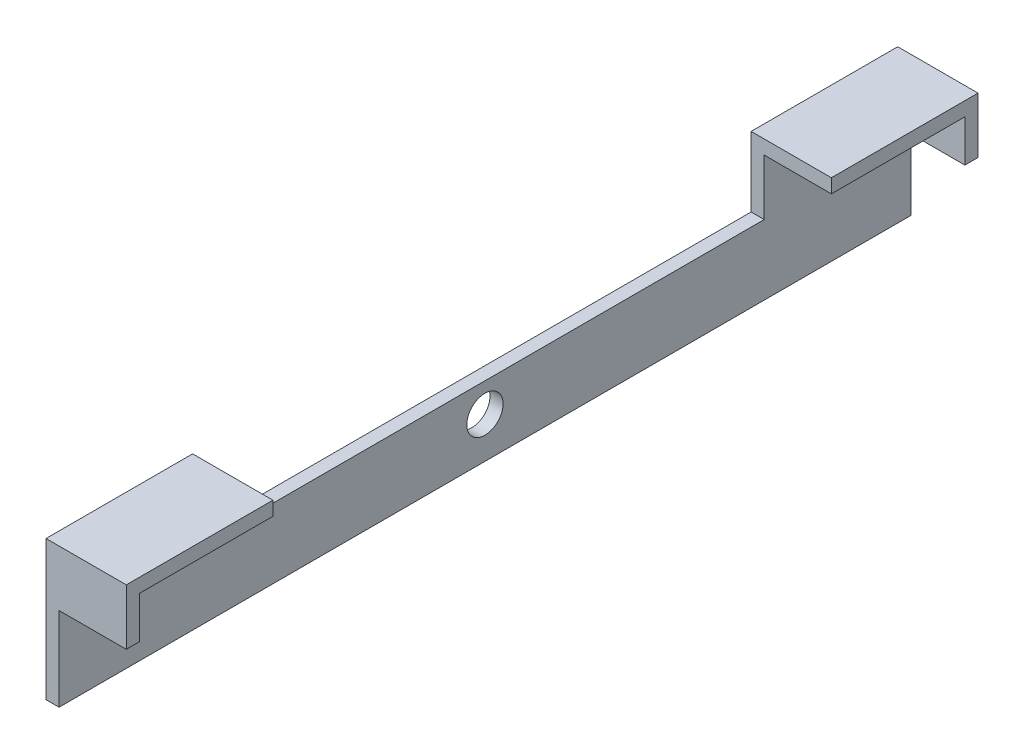
ISO-10303-21;
HEADER;
FILE_DESCRIPTION(('STEP AP214'),'2;1');
FILE_NAME('part.step','',(''),(''),'','','');
FILE_SCHEMA(('AUTOMOTIVE_DESIGN { 1 0 10303 214 1 1 1 1 }'));
ENDSEC;
DATA;
#1=APPLICATION_CONTEXT('core data for automotive mechanical design processes');
#2=APPLICATION_PROTOCOL_DEFINITION('international standard','automotive_design',2000,#1);
#3=PRODUCT_CONTEXT('',#1,'mechanical');
#4=PRODUCT('Part','Part','',(#3));
#5=PRODUCT_RELATED_PRODUCT_CATEGORY('part','',(#4));
#6=PRODUCT_DEFINITION_FORMATION('','',#4);
#7=PRODUCT_DEFINITION_CONTEXT('part definition',#1,'design');
#8=PRODUCT_DEFINITION('design','',#6,#7);
#9=PRODUCT_DEFINITION_SHAPE('','',#8);
#10=(LENGTH_UNIT() NAMED_UNIT(*) SI_UNIT(.MILLI.,.METRE.));
#11=(NAMED_UNIT(*) PLANE_ANGLE_UNIT() SI_UNIT($,.RADIAN.));
#12=(NAMED_UNIT(*) SI_UNIT($,.STERADIAN.) SOLID_ANGLE_UNIT());
#13=UNCERTAINTY_MEASURE_WITH_UNIT(LENGTH_MEASURE(1.E-05),#10,'distance_accuracy_value','');
#14=(GEOMETRIC_REPRESENTATION_CONTEXT(3) GLOBAL_UNCERTAINTY_ASSIGNED_CONTEXT((#13)) GLOBAL_UNIT_ASSIGNED_CONTEXT((#10,
#11,#12)) REPRESENTATION_CONTEXT('',''));
#15=CARTESIAN_POINT('',(0.,0.,0.));
#16=DIRECTION('',(0.,0.,1.));
#17=DIRECTION('',(1.,0.,0.));
#18=AXIS2_PLACEMENT_3D('',#15,#16,#17);
#19=CARTESIAN_POINT('',(-105.0925,45.7200000000001,-154.94));
#20=DIRECTION('',(1.,0.,0.));
#21=DIRECTION('',(0.,0.,-1.));
#22=AXIS2_PLACEMENT_3D('',#19,#20,#21);
#23=PLANE('',#22);
#24=DIRECTION('',(0.,0.,1.));
#25=VECTOR('',#24,1.);
#26=CARTESIAN_POINT('',(-105.0925,50.8000000000001,-154.94));
#27=LINE('',#26,#25);
#28=CARTESIAN_POINT('',(-105.0925,50.8000000000001,-154.94));
#29=VERTEX_POINT('',#28);
#30=CARTESIAN_POINT('',(-105.0925,50.8000000000001,-101.6));
#31=VERTEX_POINT('',#30);
#32=EDGE_CURVE('E294',#29,#31,#27,.T.);
#33=ORIENTED_EDGE('',*,*,#32,.T.);
#34=DIRECTION('',(0.,1.,0.));
#35=VECTOR('',#34,1.);
#36=CARTESIAN_POINT('',(-105.0925,25.4000000000001,-101.6));
#37=LINE('',#36,#35);
#38=CARTESIAN_POINT('',(-105.0925,45.72,-101.6));
#39=VERTEX_POINT('',#38);
#40=EDGE_CURVE('E194',#39,#31,#37,.T.);
#41=ORIENTED_EDGE('',*,*,#40,.F.);
#42=DIRECTION('',(0.,0.,1.));
#43=VECTOR('',#42,1.);
#44=CARTESIAN_POINT('',(-105.0925,45.7200000000001,-154.94));
#45=LINE('',#44,#43);
#46=CARTESIAN_POINT('',(-105.0925,45.72,-150.1775));
#47=VERTEX_POINT('',#46);
#48=EDGE_CURVE('E299',#47,#39,#45,.T.);
#49=ORIENTED_EDGE('',*,*,#48,.F.);
#50=DIRECTION('',(0.,-1.,0.));
#51=VECTOR('',#50,1.);
#52=CARTESIAN_POINT('',(-105.0925,50.8,-150.1775));
#53=LINE('',#52,#51);
#54=CARTESIAN_POINT('',(-105.0925,30.4800000000001,-150.1775));
#55=VERTEX_POINT('',#54);
#56=EDGE_CURVE('E205',#47,#55,#53,.T.);
#57=ORIENTED_EDGE('',*,*,#56,.T.);
#58=DIRECTION('',(0.,0.,-1.));
#59=VECTOR('',#58,1.);
#60=CARTESIAN_POINT('',(-105.0925,30.4800000000001,-150.1775));
#61=LINE('',#60,#59);
#62=CARTESIAN_POINT('',(-105.0925,30.48,-154.94));
#63=VERTEX_POINT('',#62);
#64=EDGE_CURVE('E212',#55,#63,#61,.T.);
#65=ORIENTED_EDGE('',*,*,#64,.T.);
#66=DIRECTION('',(0.,1.,0.));
#67=VECTOR('',#66,1.);
#68=CARTESIAN_POINT('',(-105.0925,45.7200000000001,-154.94));
#69=LINE('',#68,#67);
#70=EDGE_CURVE('E273',#63,#29,#69,.T.);
#71=ORIENTED_EDGE('',*,*,#70,.T.);
#72=EDGE_LOOP('',(#33,#41,#49,#57,#65,#71));
#73=FACE_BOUND('',#72,.T.);
#74=ADVANCED_FACE('F38',(#73),#23,.T.);
#75=CARTESIAN_POINT('',(-134.3025,14.8590000000001,0.));
#76=DIRECTION('',(1.,0.,0.));
#77=DIRECTION('',(0.,0.,-1.));
#78=AXIS2_PLACEMENT_3D('',#75,#76,#77);
#79=CYLINDRICAL_SURFACE('',#78,6.604);
#80=CARTESIAN_POINT('',(-129.54,14.8590000000001,0.));
#81=DIRECTION('',(1.,0.,0.));
#82=DIRECTION('',(0.,0.,-1.));
#83=AXIS2_PLACEMENT_3D('',#80,#81,#82);
#84=CIRCLE('',#83,6.604);
#85=CARTESIAN_POINT('',(-129.54,14.8590000000001,-6.60399999999997));
#86=VERTEX_POINT('',#85);
#87=EDGE_CURVE('E42',#86,#86,#84,.T.);
#88=CARTESIAN_POINT('',(-134.3025,14.8590000000001,0.));
#89=DIRECTION('',(1.,0.,0.));
#90=DIRECTION('',(0.,0.,-1.));
#91=AXIS2_PLACEMENT_3D('',#88,#89,#90);
#92=CIRCLE('',#91,6.604);
#93=CARTESIAN_POINT('',(-134.3025,14.8590000000001,-6.60399999999997));
#94=VERTEX_POINT('',#93);
#95=EDGE_CURVE('E463',#94,#94,#92,.T.);
#96=CARTESIAN_POINT('',(-129.54,14.8590000000001,-6.60399999999997));
#97=CARTESIAN_POINT('',(-129.589609375,14.8590000000001,-6.60399999999997));
#98=CARTESIAN_POINT('',(-129.63921875,14.8590000000001,-6.60399999999997));
#99=CARTESIAN_POINT('',(-129.7384375,14.8590000000001,-6.60399999999997));
#100=CARTESIAN_POINT('',(-129.788046875,14.8590000000001,-6.60399999999997));
#101=CARTESIAN_POINT('',(-129.887265625,14.8590000000001,-6.60399999999997));
#102=CARTESIAN_POINT('',(-129.936875,14.8590000000001,-6.60399999999997));
#103=CARTESIAN_POINT('',(-130.03609375,14.8590000000001,-6.60399999999997));
#104=CARTESIAN_POINT('',(-130.085703125,14.8590000000001,-6.60399999999997));
#105=CARTESIAN_POINT('',(-130.184921875,14.8590000000001,-6.60399999999997));
#106=CARTESIAN_POINT('',(-130.23453125,14.8590000000001,-6.60399999999997));
#107=CARTESIAN_POINT('',(-130.33375,14.8590000000001,-6.60399999999997));
#108=CARTESIAN_POINT('',(-130.383359375,14.8590000000001,-6.60399999999997));
#109=CARTESIAN_POINT('',(-130.482578125,14.8590000000001,-6.60399999999997));
#110=CARTESIAN_POINT('',(-130.5321875,14.8590000000001,-6.60399999999997));
#111=CARTESIAN_POINT('',(-130.63140625,14.8590000000001,-6.60399999999997));
#112=CARTESIAN_POINT('',(-130.681015625,14.8590000000001,-6.60399999999997));
#113=CARTESIAN_POINT('',(-130.780234375,14.8590000000001,-6.60399999999997));
#114=CARTESIAN_POINT('',(-130.82984375,14.8590000000001,-6.60399999999997));
#115=CARTESIAN_POINT('',(-130.9290625,14.8590000000001,-6.60399999999997));
#116=CARTESIAN_POINT('',(-130.978671875,14.8590000000001,-6.60399999999997));
#117=CARTESIAN_POINT('',(-131.077890625,14.8590000000001,-6.60399999999997));
#118=CARTESIAN_POINT('',(-131.1275,14.8590000000001,-6.60399999999997));
#119=CARTESIAN_POINT('',(-131.22671875,14.8590000000001,-6.60399999999997));
#120=CARTESIAN_POINT('',(-131.276328125,14.8590000000001,-6.60399999999997));
#121=CARTESIAN_POINT('',(-131.375546875,14.8590000000001,-6.60399999999997));
#122=CARTESIAN_POINT('',(-131.42515625,14.8590000000001,-6.60399999999997));
#123=CARTESIAN_POINT('',(-131.524375,14.8590000000001,-6.60399999999997));
#124=CARTESIAN_POINT('',(-131.573984375,14.8590000000001,-6.60399999999997));
#125=CARTESIAN_POINT('',(-131.673203125,14.8590000000001,-6.60399999999997));
#126=CARTESIAN_POINT('',(-131.7228125,14.8590000000001,-6.60399999999997));
#127=CARTESIAN_POINT('',(-131.82203125,14.8590000000001,-6.60399999999997));
#128=CARTESIAN_POINT('',(-131.871640625,14.8590000000001,-6.60399999999997));
#129=CARTESIAN_POINT('',(-131.970859375,14.8590000000001,-6.60399999999997));
#130=CARTESIAN_POINT('',(-132.02046875,14.8590000000001,-6.60399999999997));
#131=CARTESIAN_POINT('',(-132.1196875,14.8590000000001,-6.60399999999997));
#132=CARTESIAN_POINT('',(-132.169296875,14.8590000000001,-6.60399999999997));
#133=CARTESIAN_POINT('',(-132.268515625,14.8590000000001,-6.60399999999997));
#134=CARTESIAN_POINT('',(-132.318125,14.8590000000001,-6.60399999999997));
#135=CARTESIAN_POINT('',(-132.41734375,14.8590000000001,-6.60399999999997));
#136=CARTESIAN_POINT('',(-132.466953125,14.8590000000001,-6.60399999999997));
#137=CARTESIAN_POINT('',(-132.566171875,14.8590000000001,-6.60399999999997));
#138=CARTESIAN_POINT('',(-132.61578125,14.8590000000001,-6.60399999999997));
#139=CARTESIAN_POINT('',(-132.715,14.8590000000001,-6.60399999999997));
#140=CARTESIAN_POINT('',(-132.764609375,14.8590000000001,-6.60399999999997));
#141=CARTESIAN_POINT('',(-132.863828125,14.8590000000001,-6.60399999999997));
#142=CARTESIAN_POINT('',(-132.9134375,14.8590000000001,-6.60399999999997));
#143=CARTESIAN_POINT('',(-133.01265625,14.8590000000001,-6.60399999999997));
#144=CARTESIAN_POINT('',(-133.062265625,14.8590000000001,-6.60399999999997));
#145=CARTESIAN_POINT('',(-133.161484375,14.8590000000001,-6.60399999999997));
#146=CARTESIAN_POINT('',(-133.21109375,14.8590000000001,-6.60399999999997));
#147=CARTESIAN_POINT('',(-133.3103125,14.8590000000001,-6.60399999999997));
#148=CARTESIAN_POINT('',(-133.359921875,14.8590000000001,-6.60399999999997));
#149=CARTESIAN_POINT('',(-133.459140625,14.8590000000001,-6.60399999999997));
#150=CARTESIAN_POINT('',(-133.50875,14.8590000000001,-6.60399999999997));
#151=CARTESIAN_POINT('',(-133.60796875,14.8590000000001,-6.60399999999997));
#152=CARTESIAN_POINT('',(-133.657578125,14.8590000000001,-6.60399999999997));
#153=CARTESIAN_POINT('',(-133.756796875,14.8590000000001,-6.60399999999997));
#154=CARTESIAN_POINT('',(-133.80640625,14.8590000000001,-6.60399999999997));
#155=CARTESIAN_POINT('',(-133.905625,14.8590000000001,-6.60399999999997));
#156=CARTESIAN_POINT('',(-133.955234375,14.8590000000001,-6.60399999999997));
#157=CARTESIAN_POINT('',(-134.054453125,14.8590000000001,-6.60399999999997));
#158=CARTESIAN_POINT('',(-134.1040625,14.8590000000001,-6.60399999999997));
#159=CARTESIAN_POINT('',(-134.20328125,14.8590000000001,-6.60399999999997));
#160=CARTESIAN_POINT('',(-134.252890625,14.8590000000001,-6.60399999999997));
#161=CARTESIAN_POINT('',(-134.3025,14.8590000000001,-6.60399999999997));
#162=B_SPLINE_CURVE_WITH_KNOTS('',3,(#96,#97,#98,#99,#100,#101,#102,#103,#104,#105,#106,#107,
#108,#109,#110,#111,#112,#113,#114,#115,#116,#117,#118,#119,#120,#121,#122,#123,#124,#125,#126,
#127,#128,#129,#130,#131,#132,#133,#134,#135,#136,#137,#138,#139,#140,#141,#142,#143,#144,#145,
#146,#147,#148,#149,#150,#151,#152,#153,#154,#155,#156,#157,#158,#159,#160,#161),.UNSPECIFIED.,
.F.,.F.,(4,2,2,2,2,2,2,2,2,2,2,2,2,2,2,2,2,2,2,2,2,2,2,2,2,2,2,2,2,2,2,2,4),(0.,0.148828125,
0.29765625,0.446484375,0.5953125,0.744140625,0.892968750000001,1.041796875,1.190625,1.339453125,
1.48828125,1.637109375,1.7859375,1.934765625,2.08359375,2.232421875,2.38125,2.530078125,
2.67890625,2.827734375,2.9765625,3.125390625,3.27421875,3.423046875,3.571875,3.720703125,
3.86953125,4.018359375,4.1671875,4.316015625,4.46484375,4.613671875,4.76249999999998),.UNSPECIFIED.);
#163=EDGE_CURVE('BSEAM425',#86,#94,#162,.T.);
#164=ORIENTED_EDGE('',*,*,#87,.T.);
#165=ORIENTED_EDGE('',*,*,#95,.F.);
#166=ORIENTED_EDGE('',*,*,#163,.T.);
#167=ORIENTED_EDGE('',*,*,#163,.F.);
#168=EDGE_LOOP('',(#164,#166,#165,#167));
#169=FACE_BOUND('',#168,.T.);
#170=ADVANCED_FACE('F425',(#169),#79,.F.);
#171=CARTESIAN_POINT('',(-134.3025,0.,-154.94));
#172=DIRECTION('',(0.,-1.,0.));
#173=DIRECTION('',(0.,0.,-1.));
#174=AXIS2_PLACEMENT_3D('',#171,#172,#173);
#175=PLANE('',#174);
#176=DIRECTION('',(0.,0.,1.));
#177=VECTOR('',#176,1.);
#178=CARTESIAN_POINT('',(-129.54,0.,-154.94));
#179=LINE('',#178,#177);
#180=CARTESIAN_POINT('',(-129.54,0.,-154.94));
#181=VERTEX_POINT('',#180);
#182=CARTESIAN_POINT('',(-129.54,0.,154.94));
#183=VERTEX_POINT('',#182);
#184=EDGE_CURVE('E284',#181,#183,#179,.T.);
#185=ORIENTED_EDGE('',*,*,#184,.T.);
#186=DIRECTION('',(1.,0.,0.));
#187=VECTOR('',#186,1.);
#188=CARTESIAN_POINT('',(-134.3025,0.,154.94));
#189=LINE('',#188,#187);
#190=CARTESIAN_POINT('',(-134.3025,0.,154.94));
#191=VERTEX_POINT('',#190);
#192=EDGE_CURVE('E247',#191,#183,#189,.T.);
#193=ORIENTED_EDGE('',*,*,#192,.F.);
#194=DIRECTION('',(0.,0.,1.));
#195=VECTOR('',#194,1.);
#196=CARTESIAN_POINT('',(-134.3025,0.,-154.94));
#197=LINE('',#196,#195);
#198=CARTESIAN_POINT('',(-134.3025,0.,-154.94));
#199=VERTEX_POINT('',#198);
#200=EDGE_CURVE('E285',#199,#191,#197,.T.);
#201=ORIENTED_EDGE('',*,*,#200,.F.);
#202=DIRECTION('',(1.,0.,0.));
#203=VECTOR('',#202,1.);
#204=CARTESIAN_POINT('',(-134.3025,0.,-154.94));
#205=LINE('',#204,#203);
#206=EDGE_CURVE('E266',#199,#181,#205,.T.);
#207=ORIENTED_EDGE('',*,*,#206,.T.);
#208=EDGE_LOOP('',(#185,#193,#201,#207));
#209=FACE_BOUND('',#208,.T.);
#210=ADVANCED_FACE('F40',(#209),#175,.T.);
#211=CARTESIAN_POINT('',(0.,0.,154.94));
#212=DIRECTION('',(0.,0.,1.));
#213=DIRECTION('',(1.,0.,0.));
#214=AXIS2_PLACEMENT_3D('',#211,#212,#213);
#215=PLANE('',#214);
#216=DIRECTION('',(1.,0.,0.));
#217=VECTOR('',#216,1.);
#218=CARTESIAN_POINT('',(-134.3025,30.4800000000001,154.94));
#219=LINE('',#218,#217);
#220=CARTESIAN_POINT('',(-129.54,30.4800000000001,154.94));
#221=VERTEX_POINT('',#220);
#222=CARTESIAN_POINT('',(-105.0925,30.4800000000001,154.94));
#223=VERTEX_POINT('',#222);
#224=EDGE_CURVE('E225',#221,#223,#219,.T.);
#225=ORIENTED_EDGE('',*,*,#224,.T.);
#226=DIRECTION('',(0.,1.,0.));
#227=VECTOR('',#226,1.);
#228=CARTESIAN_POINT('',(-105.0925,45.72,154.94));
#229=LINE('',#228,#227);
#230=CARTESIAN_POINT('',(-105.0925,50.8000000000001,154.94));
#231=VERTEX_POINT('',#230);
#232=EDGE_CURVE('E255',#223,#231,#229,.T.);
#233=ORIENTED_EDGE('',*,*,#232,.T.);
#234=DIRECTION('',(-1.,0.,0.));
#235=VECTOR('',#234,1.);
#236=CARTESIAN_POINT('',(-105.0925,50.8000000000001,154.94));
#237=LINE('',#236,#235);
#238=CARTESIAN_POINT('',(-134.3025,50.8000000000001,154.94));
#239=VERTEX_POINT('',#238);
#240=EDGE_CURVE('E259',#231,#239,#237,.T.);
#241=ORIENTED_EDGE('',*,*,#240,.T.);
#242=DIRECTION('',(0.,-1.,0.));
#243=VECTOR('',#242,1.);
#244=CARTESIAN_POINT('',(-134.3025,50.8000000000001,154.94));
#245=LINE('',#244,#243);
#246=EDGE_CURVE('E263',#239,#191,#245,.T.);
#247=ORIENTED_EDGE('',*,*,#246,.T.);
#248=ORIENTED_EDGE('',*,*,#192,.T.);
#249=DIRECTION('',(0.,1.,0.));
#250=VECTOR('',#249,1.);
#251=CARTESIAN_POINT('',(-129.54,0.,154.94));
#252=LINE('',#251,#250);
#253=EDGE_CURVE('E251',#183,#221,#252,.T.);
#254=ORIENTED_EDGE('',*,*,#253,.T.);
#255=EDGE_LOOP('',(#225,#233,#241,#247,#248,#254));
#256=FACE_BOUND('',#255,.T.);
#257=ADVANCED_FACE('F353',(#256),#215,.T.);
#258=CARTESIAN_POINT('',(-134.3025,30.4800000000001,150.1775));
#259=DIRECTION('',(0.,-1.,0.));
#260=DIRECTION('',(0.,0.,-1.));
#261=AXIS2_PLACEMENT_3D('',#258,#259,#260);
#262=PLANE('',#261);
#263=ORIENTED_EDGE('',*,*,#224,.F.);
#264=DIRECTION('',(0.,0.,-1.));
#265=VECTOR('',#264,1.);
#266=CARTESIAN_POINT('',(-129.54,30.48,-154.94));
#267=LINE('',#266,#265);
#268=CARTESIAN_POINT('',(-129.54,30.4800000000001,150.1775));
#269=VERTEX_POINT('',#268);
#270=EDGE_CURVE('E240',#221,#269,#267,.T.);
#271=ORIENTED_EDGE('',*,*,#270,.T.);
#272=DIRECTION('',(1.,0.,0.));
#273=VECTOR('',#272,1.);
#274=CARTESIAN_POINT('',(-134.3025,30.4800000000001,150.1775));
#275=LINE('',#274,#273);
#276=CARTESIAN_POINT('',(-105.0925,30.4800000000001,150.1775));
#277=VERTEX_POINT('',#276);
#278=EDGE_CURVE('E230',#269,#277,#275,.T.);
#279=ORIENTED_EDGE('',*,*,#278,.T.);
#280=DIRECTION('',(0.,0.,1.));
#281=VECTOR('',#280,1.);
#282=CARTESIAN_POINT('',(-105.0925,30.4800000000001,150.1775));
#283=LINE('',#282,#281);
#284=EDGE_CURVE('E233',#277,#223,#283,.T.);
#285=ORIENTED_EDGE('',*,*,#284,.T.);
#286=EDGE_LOOP('',(#263,#271,#279,#285));
#287=FACE_BOUND('',#286,.T.);
#288=ADVANCED_FACE('F415',(#287),#262,.T.);
#289=CARTESIAN_POINT('',(0.,0.,-154.94));
#290=DIRECTION('',(0.,0.,1.));
#291=DIRECTION('',(1.,0.,0.));
#292=AXIS2_PLACEMENT_3D('',#289,#290,#291);
#293=PLANE('',#292);
#294=ORIENTED_EDGE('',*,*,#70,.F.);
#295=DIRECTION('',(-1.,0.,0.));
#296=VECTOR('',#295,1.);
#297=CARTESIAN_POINT('',(-105.0925,30.48,-154.94));
#298=LINE('',#297,#296);
#299=CARTESIAN_POINT('',(-129.54,30.48,-154.94));
#300=VERTEX_POINT('',#299);
#301=EDGE_CURVE('E204',#63,#300,#298,.T.);
#302=ORIENTED_EDGE('',*,*,#301,.T.);
#303=DIRECTION('',(0.,1.,0.));
#304=VECTOR('',#303,1.);
#305=CARTESIAN_POINT('',(-129.54,0.,-154.94));
#306=LINE('',#305,#304);
#307=EDGE_CURVE('E270',#181,#300,#306,.T.);
#308=ORIENTED_EDGE('',*,*,#307,.F.);
#309=ORIENTED_EDGE('',*,*,#206,.F.);
#310=DIRECTION('',(0.,-1.,0.));
#311=VECTOR('',#310,1.);
#312=CARTESIAN_POINT('',(-134.3025,50.8000000000001,-154.94));
#313=LINE('',#312,#311);
#314=CARTESIAN_POINT('',(-134.3025,50.8000000000001,-154.94));
#315=VERTEX_POINT('',#314);
#316=EDGE_CURVE('E281',#315,#199,#313,.T.);
#317=ORIENTED_EDGE('',*,*,#316,.F.);
#318=DIRECTION('',(-1.,0.,0.));
#319=VECTOR('',#318,1.);
#320=CARTESIAN_POINT('',(-105.0925,50.8000000000001,-154.94));
#321=LINE('',#320,#319);
#322=EDGE_CURVE('E277',#29,#315,#321,.T.);
#323=ORIENTED_EDGE('',*,*,#322,.F.);
#324=EDGE_LOOP('',(#294,#302,#308,#309,#317,#323));
#325=FACE_BOUND('',#324,.T.);
#326=ADVANCED_FACE('F340',(#325),#293,.F.);
#327=CARTESIAN_POINT('',(-105.0925,30.4800000000001,-150.1775));
#328=DIRECTION('',(0.,-1.,0.));
#329=DIRECTION('',(0.,0.,-1.));
#330=AXIS2_PLACEMENT_3D('',#327,#328,#329);
#331=PLANE('',#330);
#332=DIRECTION('',(-1.,0.,0.));
#333=VECTOR('',#332,1.);
#334=CARTESIAN_POINT('',(-105.0925,30.4800000000001,-150.1775));
#335=LINE('',#334,#333);
#336=CARTESIAN_POINT('',(-129.54,30.4800000000001,-150.1775));
#337=VERTEX_POINT('',#336);
#338=EDGE_CURVE('E208',#55,#337,#335,.T.);
#339=ORIENTED_EDGE('',*,*,#338,.T.);
#340=DIRECTION('',(0.,0.,-1.));
#341=VECTOR('',#340,1.);
#342=CARTESIAN_POINT('',(-129.54,30.48,-154.94));
#343=LINE('',#342,#341);
#344=EDGE_CURVE('E219',#337,#300,#343,.T.);
#345=ORIENTED_EDGE('',*,*,#344,.T.);
#346=ORIENTED_EDGE('',*,*,#301,.F.);
#347=ORIENTED_EDGE('',*,*,#64,.F.);
#348=EDGE_LOOP('',(#339,#345,#346,#347));
#349=FACE_BOUND('',#348,.T.);
#350=ADVANCED_FACE('F336',(#349),#331,.T.);
#351=CARTESIAN_POINT('',(-105.0925,50.8000000000001,-154.94));
#352=DIRECTION('',(0.,1.,0.));
#353=DIRECTION('',(-1.,0.,0.));
#354=AXIS2_PLACEMENT_3D('',#351,#352,#353);
#355=PLANE('',#354);
#356=DIRECTION('',(-1.,0.,0.));
#357=VECTOR('',#356,1.);
#358=CARTESIAN_POINT('',(-105.0925,50.8,101.6));
#359=LINE('',#358,#357);
#360=CARTESIAN_POINT('',(-105.0925,50.8,101.6));
#361=VERTEX_POINT('',#360);
#362=CARTESIAN_POINT('',(-134.3025,50.8,101.6));
#363=VERTEX_POINT('',#362);
#364=EDGE_CURVE('E176',#361,#363,#359,.T.);
#365=ORIENTED_EDGE('',*,*,#364,.T.);
#366=DIRECTION('',(0.,0.,1.));
#367=VECTOR('',#366,1.);
#368=CARTESIAN_POINT('',(-134.3025,50.8000000000001,-154.94));
#369=LINE('',#368,#367);
#370=EDGE_CURVE('E174',#363,#239,#369,.T.);
#371=ORIENTED_EDGE('',*,*,#370,.T.);
#372=ORIENTED_EDGE('',*,*,#240,.F.);
#373=EDGE_CURVE('E298',#361,#231,#27,.T.);
#374=ORIENTED_EDGE('',*,*,#373,.F.);
#375=EDGE_LOOP('',(#365,#371,#372,#374));
#376=FACE_BOUND('',#375,.T.);
#377=ADVANCED_FACE('F357',(#376),#355,.T.);
#378=CARTESIAN_POINT('',(-129.54,45.7200000000001,-154.94));
#379=DIRECTION('',(0.,-1.,0.));
#380=DIRECTION('',(0.,0.,-1.));
#381=AXIS2_PLACEMENT_3D('',#378,#379,#380);
#382=PLANE('',#381);
#383=ORIENTED_EDGE('',*,*,#48,.T.);
#384=DIRECTION('',(-1.,0.,0.));
#385=VECTOR('',#384,1.);
#386=CARTESIAN_POINT('',(-129.54,45.72,-101.6));
#387=LINE('',#386,#385);
#388=CARTESIAN_POINT('',(-129.54,45.72,-101.6));
#389=VERTEX_POINT('',#388);
#390=EDGE_CURVE('E197',#39,#389,#387,.T.);
#391=ORIENTED_EDGE('',*,*,#390,.T.);
#392=DIRECTION('',(0.,0.,1.));
#393=VECTOR('',#392,1.);
#394=CARTESIAN_POINT('',(-129.54,45.7200000000001,-154.94));
#395=LINE('',#394,#393);
#396=CARTESIAN_POINT('',(-129.54,45.72,-150.1775));
#397=VERTEX_POINT('',#396);
#398=EDGE_CURVE('E303',#397,#389,#395,.T.);
#399=ORIENTED_EDGE('',*,*,#398,.F.);
#400=DIRECTION('',(1.,0.,0.));
#401=VECTOR('',#400,1.);
#402=CARTESIAN_POINT('',(-129.54,45.72,-150.1775));
#403=LINE('',#402,#401);
#404=EDGE_CURVE('E63',#397,#47,#403,.T.);
#405=ORIENTED_EDGE('',*,*,#404,.T.);
#406=EDGE_LOOP('',(#383,#391,#399,#405));
#407=FACE_BOUND('',#406,.T.);
#408=ADVANCED_FACE('F327',(#407),#382,.T.);
#409=CARTESIAN_POINT('',(-129.54,0.,-154.94));
#410=DIRECTION('',(1.,0.,0.));
#411=DIRECTION('',(0.,0.,-1.));
#412=AXIS2_PLACEMENT_3D('',#409,#410,#411);
#413=PLANE('',#412);
#414=ORIENTED_EDGE('',*,*,#87,.F.);
#415=EDGE_LOOP('',(#414));
#416=FACE_BOUND('',#415,.T.);
#417=DIRECTION('',(0.,-1.,0.));
#418=VECTOR('',#417,1.);
#419=CARTESIAN_POINT('',(-129.54,0.,101.6));
#420=LINE('',#419,#418);
#421=CARTESIAN_POINT('',(-129.54,45.72,101.6));
#422=VERTEX_POINT('',#421);
#423=CARTESIAN_POINT('',(-129.54,25.4000000000001,101.6));
#424=VERTEX_POINT('',#423);
#425=EDGE_CURVE('E11',#422,#424,#420,.T.);
#426=ORIENTED_EDGE('',*,*,#425,.F.);
#427=CARTESIAN_POINT('',(-129.54,45.72,150.1775));
#428=VERTEX_POINT('',#427);
#429=EDGE_CURVE('E307',#422,#428,#395,.T.);
#430=ORIENTED_EDGE('',*,*,#429,.T.);
#431=DIRECTION('',(0.,-1.,0.));
#432=VECTOR('',#431,1.);
#433=CARTESIAN_POINT('',(-129.54,1.11022302462516E-13,150.1775));
#434=LINE('',#433,#432);
#435=EDGE_CURVE('E289',#428,#269,#434,.T.);
#436=ORIENTED_EDGE('',*,*,#435,.T.);
#437=ORIENTED_EDGE('',*,*,#270,.F.);
#438=ORIENTED_EDGE('',*,*,#253,.F.);
#439=ORIENTED_EDGE('',*,*,#184,.F.);
#440=ORIENTED_EDGE('',*,*,#307,.T.);
#441=ORIENTED_EDGE('',*,*,#344,.F.);
#442=DIRECTION('',(0.,1.,0.));
#443=VECTOR('',#442,1.);
#444=CARTESIAN_POINT('',(-129.54,0.,-150.1775));
#445=LINE('',#444,#443);
#446=EDGE_CURVE('E313',#337,#397,#445,.T.);
#447=ORIENTED_EDGE('',*,*,#446,.T.);
#448=ORIENTED_EDGE('',*,*,#398,.T.);
#449=DIRECTION('',(0.,-1.,0.));
#450=VECTOR('',#449,1.);
#451=CARTESIAN_POINT('',(-129.54,1.11022302462516E-13,-101.6));
#452=LINE('',#451,#450);
#453=CARTESIAN_POINT('',(-129.54,25.4000000000001,-101.6));
#454=VERTEX_POINT('',#453);
#455=EDGE_CURVE('E316',#389,#454,#452,.T.);
#456=ORIENTED_EDGE('',*,*,#455,.T.);
#457=DIRECTION('',(0.,0.,1.));
#458=VECTOR('',#457,1.);
#459=CARTESIAN_POINT('',(-129.54,25.4,-154.94));
#460=LINE('',#459,#458);
#461=EDGE_CURVE('E48',#454,#424,#460,.T.);
#462=ORIENTED_EDGE('',*,*,#461,.T.);
#463=EDGE_LOOP('',(#426,#430,#436,#437,#438,#439,#440,#441,#447,#448,#456,#462));
#464=FACE_BOUND('',#463,.T.);
#465=ADVANCED_FACE('F323',(#416,#464),#413,.T.);
#466=CARTESIAN_POINT('',(-134.3025,25.4000000000001,101.6));
#467=DIRECTION('',(0.,1.,0.));
#468=DIRECTION('',(0.,0.,1.));
#469=AXIS2_PLACEMENT_3D('',#466,#467,#468);
#470=PLANE('',#469);
#471=DIRECTION('',(1.,0.,0.));
#472=VECTOR('',#471,1.);
#473=CARTESIAN_POINT('',(-134.3025,25.4000000000001,-101.6));
#474=LINE('',#473,#472);
#475=CARTESIAN_POINT('',(-134.3025,25.4000000000001,-101.6));
#476=VERTEX_POINT('',#475);
#477=EDGE_CURVE('E55',#476,#454,#474,.T.);
#478=ORIENTED_EDGE('',*,*,#477,.F.);
#479=DIRECTION('',(0.,0.,-1.));
#480=VECTOR('',#479,1.);
#481=CARTESIAN_POINT('',(-134.3025,25.4000000000001,101.6));
#482=LINE('',#481,#480);
#483=CARTESIAN_POINT('',(-134.3025,25.4000000000001,101.6));
#484=VERTEX_POINT('',#483);
#485=EDGE_CURVE('E154',#484,#476,#482,.T.);
#486=ORIENTED_EDGE('',*,*,#485,.F.);
#487=DIRECTION('',(1.,0.,0.));
#488=VECTOR('',#487,1.);
#489=CARTESIAN_POINT('',(-134.3025,25.4000000000001,101.6));
#490=LINE('',#489,#488);
#491=EDGE_CURVE('E157',#484,#424,#490,.T.);
#492=ORIENTED_EDGE('',*,*,#491,.T.);
#493=ORIENTED_EDGE('',*,*,#461,.F.);
#494=EDGE_LOOP('',(#478,#486,#492,#493));
#495=FACE_BOUND('',#494,.T.);
#496=ADVANCED_FACE('F156',(#495),#470,.T.);
#497=CARTESIAN_POINT('',(-134.3025,50.8000000000001,-154.94));
#498=DIRECTION('',(-1.,0.,0.));
#499=DIRECTION('',(0.,0.,1.));
#500=AXIS2_PLACEMENT_3D('',#497,#498,#499);
#501=PLANE('',#500);
#502=ORIENTED_EDGE('',*,*,#95,.T.);
#503=EDGE_LOOP('',(#502));
#504=FACE_BOUND('',#503,.T.);
#505=DIRECTION('',(0.,-1.,0.));
#506=VECTOR('',#505,1.);
#507=CARTESIAN_POINT('',(-134.3025,50.8,101.6));
#508=LINE('',#507,#506);
#509=EDGE_CURVE('E166',#363,#484,#508,.T.);
#510=ORIENTED_EDGE('',*,*,#509,.T.);
#511=ORIENTED_EDGE('',*,*,#485,.T.);
#512=DIRECTION('',(0.,-1.,0.));
#513=VECTOR('',#512,1.);
#514=CARTESIAN_POINT('',(-134.3025,50.8000000000001,-101.6));
#515=LINE('',#514,#513);
#516=CARTESIAN_POINT('',(-134.3025,50.8000000000001,-101.6));
#517=VERTEX_POINT('',#516);
#518=EDGE_CURVE('E188',#517,#476,#515,.T.);
#519=ORIENTED_EDGE('',*,*,#518,.F.);
#520=EDGE_CURVE('E290',#315,#517,#369,.T.);
#521=ORIENTED_EDGE('',*,*,#520,.F.);
#522=ORIENTED_EDGE('',*,*,#316,.T.);
#523=ORIENTED_EDGE('',*,*,#200,.T.);
#524=ORIENTED_EDGE('',*,*,#246,.F.);
#525=ORIENTED_EDGE('',*,*,#370,.F.);
#526=EDGE_LOOP('',(#510,#511,#519,#521,#522,#523,#524,#525));
#527=FACE_BOUND('',#526,.T.);
#528=ADVANCED_FACE('F172',(#504,#527),#501,.T.);
#529=ORIENTED_EDGE('',*,*,#520,.T.);
#530=DIRECTION('',(-1.,0.,0.));
#531=VECTOR('',#530,1.);
#532=CARTESIAN_POINT('',(-105.0925,50.8000000000001,-101.6));
#533=LINE('',#532,#531);
#534=EDGE_CURVE('E191',#31,#517,#533,.T.);
#535=ORIENTED_EDGE('',*,*,#534,.F.);
#536=ORIENTED_EDGE('',*,*,#32,.F.);
#537=ORIENTED_EDGE('',*,*,#322,.T.);
#538=EDGE_LOOP('',(#529,#535,#536,#537));
#539=FACE_BOUND('',#538,.T.);
#540=ADVANCED_FACE('F345',(#539),#355,.T.);
#541=CARTESIAN_POINT('',(0.,1.11022302462516E-13,-101.6));
#542=DIRECTION('',(0.,0.,1.));
#543=DIRECTION('',(1.,0.,0.));
#544=AXIS2_PLACEMENT_3D('',#541,#542,#543);
#545=PLANE('',#544);
#546=ORIENTED_EDGE('',*,*,#40,.T.);
#547=ORIENTED_EDGE('',*,*,#534,.T.);
#548=ORIENTED_EDGE('',*,*,#518,.T.);
#549=ORIENTED_EDGE('',*,*,#477,.T.);
#550=ORIENTED_EDGE('',*,*,#455,.F.);
#551=ORIENTED_EDGE('',*,*,#390,.F.);
#552=EDGE_LOOP('',(#546,#547,#548,#549,#550,#551));
#553=FACE_BOUND('',#552,.T.);
#554=ADVANCED_FACE('F325',(#553),#545,.T.);
#555=DIRECTION('',(-1.,0.,0.));
#556=VECTOR('',#555,1.);
#557=CARTESIAN_POINT('',(-129.54,45.72,101.6));
#558=LINE('',#557,#556);
#559=CARTESIAN_POINT('',(-105.0925,45.72,101.6));
#560=VERTEX_POINT('',#559);
#561=EDGE_CURVE('E201',#560,#422,#558,.T.);
#562=ORIENTED_EDGE('',*,*,#561,.F.);
#563=CARTESIAN_POINT('',(-105.0925,45.72,150.1775));
#564=VERTEX_POINT('',#563);
#565=EDGE_CURVE('E302',#560,#564,#45,.T.);
#566=ORIENTED_EDGE('',*,*,#565,.T.);
#567=DIRECTION('',(-1.,0.,0.));
#568=VECTOR('',#567,1.);
#569=CARTESIAN_POINT('',(-129.54,45.72,150.1775));
#570=LINE('',#569,#568);
#571=EDGE_CURVE('E243',#564,#428,#570,.T.);
#572=ORIENTED_EDGE('',*,*,#571,.T.);
#573=ORIENTED_EDGE('',*,*,#429,.F.);
#574=EDGE_LOOP('',(#562,#566,#572,#573));
#575=FACE_BOUND('',#574,.T.);
#576=ADVANCED_FACE('F409',(#575),#382,.T.);
#577=CARTESIAN_POINT('',(0.,0.,101.6));
#578=DIRECTION('',(0.,0.,1.));
#579=DIRECTION('',(1.,0.,0.));
#580=AXIS2_PLACEMENT_3D('',#577,#578,#579);
#581=PLANE('',#580);
#582=ORIENTED_EDGE('',*,*,#561,.T.);
#583=ORIENTED_EDGE('',*,*,#425,.T.);
#584=ORIENTED_EDGE('',*,*,#491,.F.);
#585=ORIENTED_EDGE('',*,*,#509,.F.);
#586=ORIENTED_EDGE('',*,*,#364,.F.);
#587=DIRECTION('',(0.,1.,0.));
#588=VECTOR('',#587,1.);
#589=CARTESIAN_POINT('',(-105.0925,25.4000000000001,101.6));
#590=LINE('',#589,#588);
#591=EDGE_CURVE('E180',#560,#361,#590,.T.);
#592=ORIENTED_EDGE('',*,*,#591,.F.);
#593=EDGE_LOOP('',(#582,#583,#584,#585,#586,#592));
#594=FACE_BOUND('',#593,.T.);
#595=ADVANCED_FACE('F165',(#594),#581,.F.);
#596=CARTESIAN_POINT('',(0.,0.,-150.1775));
#597=DIRECTION('',(0.,0.,-1.));
#598=DIRECTION('',(-1.,0.,0.));
#599=AXIS2_PLACEMENT_3D('',#596,#597,#598);
#600=PLANE('',#599);
#601=ORIENTED_EDGE('',*,*,#404,.F.);
#602=ORIENTED_EDGE('',*,*,#446,.F.);
#603=ORIENTED_EDGE('',*,*,#338,.F.);
#604=ORIENTED_EDGE('',*,*,#56,.F.);
#605=EDGE_LOOP('',(#601,#602,#603,#604));
#606=FACE_BOUND('',#605,.T.);
#607=ADVANCED_FACE('F333',(#606),#600,.F.);
#608=CARTESIAN_POINT('',(0.,1.11022302462516E-13,150.1775));
#609=DIRECTION('',(0.,0.,1.));
#610=DIRECTION('',(1.,0.,0.));
#611=AXIS2_PLACEMENT_3D('',#608,#609,#610);
#612=PLANE('',#611);
#613=ORIENTED_EDGE('',*,*,#571,.F.);
#614=DIRECTION('',(0.,1.,0.));
#615=VECTOR('',#614,1.);
#616=CARTESIAN_POINT('',(-105.0925,30.4800000000001,150.1775));
#617=LINE('',#616,#615);
#618=EDGE_CURVE('E226',#277,#564,#617,.T.);
#619=ORIENTED_EDGE('',*,*,#618,.F.);
#620=ORIENTED_EDGE('',*,*,#278,.F.);
#621=ORIENTED_EDGE('',*,*,#435,.F.);
#622=EDGE_LOOP('',(#613,#619,#620,#621));
#623=FACE_BOUND('',#622,.T.);
#624=ADVANCED_FACE('F407',(#623),#612,.F.);
#625=ORIENTED_EDGE('',*,*,#591,.T.);
#626=ORIENTED_EDGE('',*,*,#373,.T.);
#627=ORIENTED_EDGE('',*,*,#232,.F.);
#628=ORIENTED_EDGE('',*,*,#284,.F.);
#629=ORIENTED_EDGE('',*,*,#618,.T.);
#630=ORIENTED_EDGE('',*,*,#565,.F.);
#631=EDGE_LOOP('',(#625,#626,#627,#628,#629,#630));
#632=FACE_BOUND('',#631,.T.);
#633=ADVANCED_FACE('F412',(#632),#23,.T.);
#634=CLOSED_SHELL('',(#74,#170,#210,#257,#288,#326,#350,#377,#408,#465,#496,#528,#540,#554,#576,
#595,#607,#624,#633));
#635=MANIFOLD_SOLID_BREP('B2',#634);
#636=ADVANCED_BREP_SHAPE_REPRESENTATION('',(#18,#635),#14);
#637=SHAPE_DEFINITION_REPRESENTATION(#9,#636);
ENDSEC;
END-ISO-10303-21;
